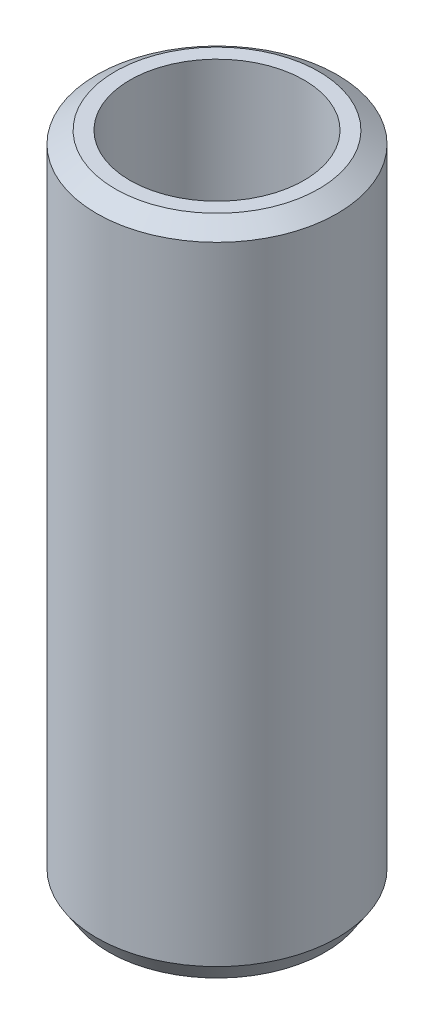
ISO-10303-21;
HEADER;
FILE_DESCRIPTION(('STEP AP214'),'2;1');
FILE_NAME('part.step','',(''),(''),'','','');
FILE_SCHEMA(('AUTOMOTIVE_DESIGN { 1 0 10303 214 1 1 1 1 }'));
ENDSEC;
DATA;
#1=APPLICATION_CONTEXT('core data for automotive mechanical design processes');
#2=APPLICATION_PROTOCOL_DEFINITION('international standard','automotive_design',2000,#1);
#3=PRODUCT_CONTEXT('',#1,'mechanical');
#4=PRODUCT('Part','Part','',(#3));
#5=PRODUCT_RELATED_PRODUCT_CATEGORY('part','',(#4));
#6=PRODUCT_DEFINITION_FORMATION('','',#4);
#7=PRODUCT_DEFINITION_CONTEXT('part definition',#1,'design');
#8=PRODUCT_DEFINITION('design','',#6,#7);
#9=PRODUCT_DEFINITION_SHAPE('','',#8);
#10=(LENGTH_UNIT() NAMED_UNIT(*) SI_UNIT(.MILLI.,.METRE.));
#11=(NAMED_UNIT(*) PLANE_ANGLE_UNIT() SI_UNIT($,.RADIAN.));
#12=(NAMED_UNIT(*) SI_UNIT($,.STERADIAN.) SOLID_ANGLE_UNIT());
#13=UNCERTAINTY_MEASURE_WITH_UNIT(LENGTH_MEASURE(1.E-05),#10,'distance_accuracy_value','');
#14=(GEOMETRIC_REPRESENTATION_CONTEXT(3) GLOBAL_UNCERTAINTY_ASSIGNED_CONTEXT((#13)) GLOBAL_UNIT_ASSIGNED_CONTEXT((#10,
#11,#12)) REPRESENTATION_CONTEXT('',''));
#15=CARTESIAN_POINT('',(0.,0.,0.));
#16=DIRECTION('',(0.,0.,1.));
#17=DIRECTION('',(1.,0.,0.));
#18=AXIS2_PLACEMENT_3D('',#15,#16,#17);
#19=CARTESIAN_POINT('',(0.,136.762048514149,0.));
#20=DIRECTION('',(0.,-1.,0.));
#21=DIRECTION('',(0.,0.,-1.));
#22=AXIS2_PLACEMENT_3D('',#19,#20,#21);
#23=CYLINDRICAL_SURFACE('',#22,25.);
#24=CARTESIAN_POINT('',(0.,134.243218672978,0.));
#25=DIRECTION('',(0.,1.,0.));
#26=DIRECTION('',(0.,0.,1.));
#27=AXIS2_PLACEMENT_3D('',#24,#25,#26);
#28=CIRCLE('',#27,25.);
#29=CARTESIAN_POINT('',(0.,134.243218672978,25.));
#30=VERTEX_POINT('',#29);
#31=EDGE_CURVE('E50',#30,#30,#28,.F.);
#32=ORIENTED_EDGE('',*,*,#31,.T.);
#33=EDGE_LOOP('',(#32));
#34=FACE_BOUND('',#33,.T.);
#35=CARTESIAN_POINT('',(0.,3.83649206574252,0.));
#36=DIRECTION('',(0.,1.,0.));
#37=DIRECTION('',(0.,0.,1.));
#38=AXIS2_PLACEMENT_3D('',#35,#36,#37);
#39=CIRCLE('',#38,25.);
#40=CARTESIAN_POINT('',(0.,3.83649206574252,25.));
#41=VERTEX_POINT('',#40);
#42=EDGE_CURVE('E51',#41,#41,#39,.T.);
#43=ORIENTED_EDGE('',*,*,#42,.T.);
#44=EDGE_LOOP('',(#43));
#45=FACE_BOUND('',#44,.T.);
#46=ADVANCED_FACE('F39',(#34,#45),#23,.T.);
#47=CARTESIAN_POINT('',(0.,136.762048514149,0.));
#48=DIRECTION('',(0.,1.,0.));
#49=DIRECTION('',(0.,0.,1.));
#50=AXIS2_PLACEMENT_3D('',#47,#48,#49);
#51=PLANE('',#50);
#52=CARTESIAN_POINT('',(0.,136.762048514149,0.));
#53=DIRECTION('',(0.,1.,0.));
#54=DIRECTION('',(0.,0.,1.));
#55=AXIS2_PLACEMENT_3D('',#52,#53,#54);
#56=CIRCLE('',#55,21.1635079342575);
#57=CARTESIAN_POINT('',(0.,136.762048514149,21.1635079342575));
#58=VERTEX_POINT('',#57);
#59=EDGE_CURVE('E54',#58,#58,#56,.T.);
#60=ORIENTED_EDGE('',*,*,#59,.T.);
#61=EDGE_LOOP('',(#60));
#62=FACE_BOUND('',#61,.T.);
#63=CARTESIAN_POINT('',(0.,136.762048514149,0.));
#64=DIRECTION('',(0.,1.,0.));
#65=DIRECTION('',(0.,0.,1.));
#66=AXIS2_PLACEMENT_3D('',#63,#64,#65);
#67=CIRCLE('',#66,18.0928244676007);
#68=CARTESIAN_POINT('',(0.,136.762048514149,18.0928244676007));
#69=VERTEX_POINT('',#68);
#70=EDGE_CURVE('E58',#69,#69,#67,.T.);
#71=ORIENTED_EDGE('',*,*,#70,.F.);
#72=EDGE_LOOP('',(#71));
#73=FACE_BOUND('',#72,.T.);
#74=ADVANCED_FACE('F69',(#62,#73),#51,.T.);
#75=CARTESIAN_POINT('',(0.,0.,0.));
#76=DIRECTION('',(0.,1.,0.));
#77=DIRECTION('',(0.,0.,1.));
#78=AXIS2_PLACEMENT_3D('',#75,#76,#77);
#79=PLANE('',#78);
#80=CARTESIAN_POINT('',(0.,0.,0.));
#81=DIRECTION('',(0.,1.,0.));
#82=DIRECTION('',(0.,0.,1.));
#83=AXIS2_PLACEMENT_3D('',#80,#81,#82);
#84=CIRCLE('',#83,22.481170158829);
#85=CARTESIAN_POINT('',(0.,0.,22.481170158829));
#86=VERTEX_POINT('',#85);
#87=EDGE_CURVE('E10',#86,#86,#84,.F.);
#88=ORIENTED_EDGE('',*,*,#87,.T.);
#89=EDGE_LOOP('',(#88));
#90=FACE_BOUND('',#89,.T.);
#91=CARTESIAN_POINT('',(0.,0.,0.));
#92=DIRECTION('',(0.,1.,0.));
#93=DIRECTION('',(0.,0.,1.));
#94=AXIS2_PLACEMENT_3D('',#91,#92,#93);
#95=CIRCLE('',#94,18.0928244676007);
#96=CARTESIAN_POINT('',(0.,0.,18.0928244676007));
#97=VERTEX_POINT('',#96);
#98=EDGE_CURVE('E63',#97,#97,#95,.T.);
#99=ORIENTED_EDGE('',*,*,#98,.T.);
#100=EDGE_LOOP('',(#99));
#101=FACE_BOUND('',#100,.T.);
#102=ADVANCED_FACE('F75',(#90,#101),#79,.F.);
#103=CARTESIAN_POINT('',(0.,136.762048514149,0.));
#104=DIRECTION('',(0.,-1.,0.));
#105=DIRECTION('',(0.,0.,-1.));
#106=AXIS2_PLACEMENT_3D('',#103,#104,#105);
#107=CYLINDRICAL_SURFACE('',#106,18.0928244676007);
#108=ORIENTED_EDGE('',*,*,#70,.T.);
#109=EDGE_LOOP('',(#108));
#110=FACE_BOUND('',#109,.T.);
#111=ORIENTED_EDGE('',*,*,#98,.F.);
#112=EDGE_LOOP('',(#111));
#113=FACE_BOUND('',#112,.T.);
#114=ADVANCED_FACE('F70',(#110,#113),#107,.F.);
#115=CARTESIAN_POINT('',(0.,136.762048514149,0.));
#116=DIRECTION('',(0.,-1.,0.));
#117=DIRECTION('',(0.,0.,-1.));
#118=AXIS2_PLACEMENT_3D('',#115,#116,#117);
#119=CONICAL_SURFACE('',#118,21.1635079342575,0.989833774421891);
#120=ORIENTED_EDGE('',*,*,#31,.F.);
#121=EDGE_LOOP('',(#120));
#122=FACE_BOUND('',#121,.T.);
#123=ORIENTED_EDGE('',*,*,#59,.F.);
#124=EDGE_LOOP('',(#123));
#125=FACE_BOUND('',#124,.T.);
#126=ADVANCED_FACE('F81',(#122,#125),#119,.T.);
#127=CARTESIAN_POINT('',(0.,3.83649206574252,0.));
#128=DIRECTION('',(0.,1.,0.));
#129=DIRECTION('',(0.,0.,1.));
#130=AXIS2_PLACEMENT_3D('',#127,#128,#129);
#131=CONICAL_SURFACE('',#130,25.,0.580962552373006);
#132=CARTESIAN_POINT('',(0.,0.,22.481170158829));
#133=CARTESIAN_POINT('',(0.,0.0399634590181508,22.5074079696745));
#134=CARTESIAN_POINT('',(0.,0.0799269180363021,22.5336457805201));
#135=CARTESIAN_POINT('',(0.,0.159853836072605,22.5861214022111));
#136=CARTESIAN_POINT('',(0.,0.199817295090756,22.6123592130566));
#137=CARTESIAN_POINT('',(0.,0.279744213127058,22.6648348347477));
#138=CARTESIAN_POINT('',(0.,0.31970767214521,22.6910726455932));
#139=CARTESIAN_POINT('',(0.,0.399634590181512,22.7435482672843));
#140=CARTESIAN_POINT('',(0.,0.439598049199663,22.7697860781298));
#141=CARTESIAN_POINT('',(0.,0.519524967235966,22.8222616998209));
#142=CARTESIAN_POINT('',(0.,0.559488426254117,22.8484995106664));
#143=CARTESIAN_POINT('',(0.,0.639415344290419,22.9009751323575));
#144=CARTESIAN_POINT('',(0.,0.67937880330857,22.927212943203));
#145=CARTESIAN_POINT('',(0.,0.759305721344873,22.9796885648941));
#146=CARTESIAN_POINT('',(0.,0.799269180363025,23.0059263757396));
#147=CARTESIAN_POINT('',(0.,0.879196098399327,23.0584019974307));
#148=CARTESIAN_POINT('',(0.,0.919159557417478,23.0846398082762));
#149=CARTESIAN_POINT('',(0.,0.999086475453781,23.1371154299673));
#150=CARTESIAN_POINT('',(0.,1.03904993447193,23.1633532408128));
#151=CARTESIAN_POINT('',(0.,1.11897685250823,23.2158288625039));
#152=CARTESIAN_POINT('',(0.,1.15894031152639,23.2420666733494));
#153=CARTESIAN_POINT('',(0.,1.23886722956269,23.2945422950405));
#154=CARTESIAN_POINT('',(0.,1.27883068858084,23.320780105886));
#155=CARTESIAN_POINT('',(0.,1.35875760661714,23.3732557275771));
#156=CARTESIAN_POINT('',(0.,1.39872106563529,23.3994935384226));
#157=CARTESIAN_POINT('',(0.,1.4786479836716,23.4519691601136));
#158=CARTESIAN_POINT('',(0.,1.51861144268975,23.4782069709592));
#159=CARTESIAN_POINT('',(0.,1.59853836072605,23.5306825926502));
#160=CARTESIAN_POINT('',(0.,1.6385018197442,23.5569204034958));
#161=CARTESIAN_POINT('',(0.,1.7184287377805,23.6093960251868));
#162=CARTESIAN_POINT('',(0.,1.75839219679865,23.6356338360324));
#163=CARTESIAN_POINT('',(0.,1.83831911483496,23.6881094577234));
#164=CARTESIAN_POINT('',(0.,1.87828257385311,23.714347268569));
#165=CARTESIAN_POINT('',(0.,1.95820949188941,23.76682289026));
#166=CARTESIAN_POINT('',(0.,1.99817295090756,23.7930607011056));
#167=CARTESIAN_POINT('',(0.,2.07809986894386,23.8455363227966));
#168=CARTESIAN_POINT('',(0.,2.11806332796202,23.8717741336422));
#169=CARTESIAN_POINT('',(0.,2.19799024599832,23.9242497553332));
#170=CARTESIAN_POINT('',(0.,2.23795370501647,23.9504875661787));
#171=CARTESIAN_POINT('',(0.,2.31788062305277,24.0029631878698));
#172=CARTESIAN_POINT('',(0.,2.35784408207092,24.0292009987153));
#173=CARTESIAN_POINT('',(0.,2.43777100010723,24.0816766204064));
#174=CARTESIAN_POINT('',(0.,2.47773445912538,24.1079144312519));
#175=CARTESIAN_POINT('',(0.,2.55766137716168,24.160390052943));
#176=CARTESIAN_POINT('',(0.,2.59762483617983,24.1866278637885));
#177=CARTESIAN_POINT('',(0.,2.67755175421613,24.2391034854796));
#178=CARTESIAN_POINT('',(0.,2.71751521323428,24.2653412963251));
#179=CARTESIAN_POINT('',(0.,2.79744213127059,24.3178169180162));
#180=CARTESIAN_POINT('',(0.,2.83740559028874,24.3440547288617));
#181=CARTESIAN_POINT('',(0.,2.91733250832504,24.3965303505528));
#182=CARTESIAN_POINT('',(0.,2.95729596734319,24.4227681613983));
#183=CARTESIAN_POINT('',(0.,3.03722288537949,24.4752437830894));
#184=CARTESIAN_POINT('',(0.,3.07718634439765,24.5014815939349));
#185=CARTESIAN_POINT('',(0.,3.15711326243395,24.553957215626));
#186=CARTESIAN_POINT('',(0.,3.1970767214521,24.5801950264715));
#187=CARTESIAN_POINT('',(0.,3.2770036394884,24.6326706481626));
#188=CARTESIAN_POINT('',(0.,3.31696709850655,24.6589084590081));
#189=CARTESIAN_POINT('',(0.,3.39689401654286,24.7113840806992));
#190=CARTESIAN_POINT('',(0.,3.43685747556101,24.7376218915447));
#191=CARTESIAN_POINT('',(0.,3.51678439359731,24.7900975132358));
#192=CARTESIAN_POINT('',(0.,3.55674785261546,24.8163353240813));
#193=CARTESIAN_POINT('',(0.,3.63667477065176,24.8688109457723));
#194=CARTESIAN_POINT('',(0.,3.67663822966991,24.8950487566179));
#195=CARTESIAN_POINT('',(0.,3.75656514770622,24.9475243783089));
#196=CARTESIAN_POINT('',(0.,3.79652860672437,24.9737621891545));
#197=CARTESIAN_POINT('',(0.,3.83649206574252,25.));
#198=B_SPLINE_CURVE_WITH_KNOTS('',3,(#132,#133,#134,#135,#136,#137,#138,#139,#140,#141,#142,
#143,#144,#145,#146,#147,#148,#149,#150,#151,#152,#153,#154,#155,#156,#157,#158,#159,#160,#161,
#162,#163,#164,#165,#166,#167,#168,#169,#170,#171,#172,#173,#174,#175,#176,#177,#178,#179,#180,
#181,#182,#183,#184,#185,#186,#187,#188,#189,#190,#191,#192,#193,#194,#195,#196,#197),
.UNSPECIFIED.,.F.,.F.,(4,2,2,2,2,2,2,2,2,2,2,2,2,2,2,2,2,2,2,2,2,2,2,2,2,2,2,2,2,2,2,2,4),(0.,
0.143420734107562,0.286841468215125,0.430262202322687,0.573682936430249,0.717103670537812,
0.860524404645374,1.00394513875293,1.1473658728605,1.29078660696806,1.43420734107562,
1.57762807518318,1.72104880929075,1.86446954339831,2.00789027750587,2.15131101161343,
2.294731745721,2.43815247982856,2.58157321393612,2.72499394804368,2.86841468215125,
3.01183541625881,3.15525615036637,3.29867688447393,3.44209761858149,3.58551835268906,
3.72893908679662,3.87235982090418,4.01578055501174,4.1592012891193,4.30262202322687,
4.44604275733443,4.58946349144199),.UNSPECIFIED.);
#199=EDGE_CURVE('BSEAM45',#86,#41,#198,.T.);
#200=ORIENTED_EDGE('',*,*,#87,.F.);
#201=ORIENTED_EDGE('',*,*,#42,.F.);
#202=ORIENTED_EDGE('',*,*,#199,.T.);
#203=ORIENTED_EDGE('',*,*,#199,.F.);
#204=EDGE_LOOP('',(#200,#202,#201,#203));
#205=FACE_BOUND('',#204,.T.);
#206=ADVANCED_FACE('F45',(#205),#131,.T.);
#207=CLOSED_SHELL('',(#46,#74,#102,#114,#126,#206));
#208=MANIFOLD_SOLID_BREP('B2',#207);
#209=ADVANCED_BREP_SHAPE_REPRESENTATION('',(#18,#208),#14);
#210=SHAPE_DEFINITION_REPRESENTATION(#9,#209);
ENDSEC;
END-ISO-10303-21;
